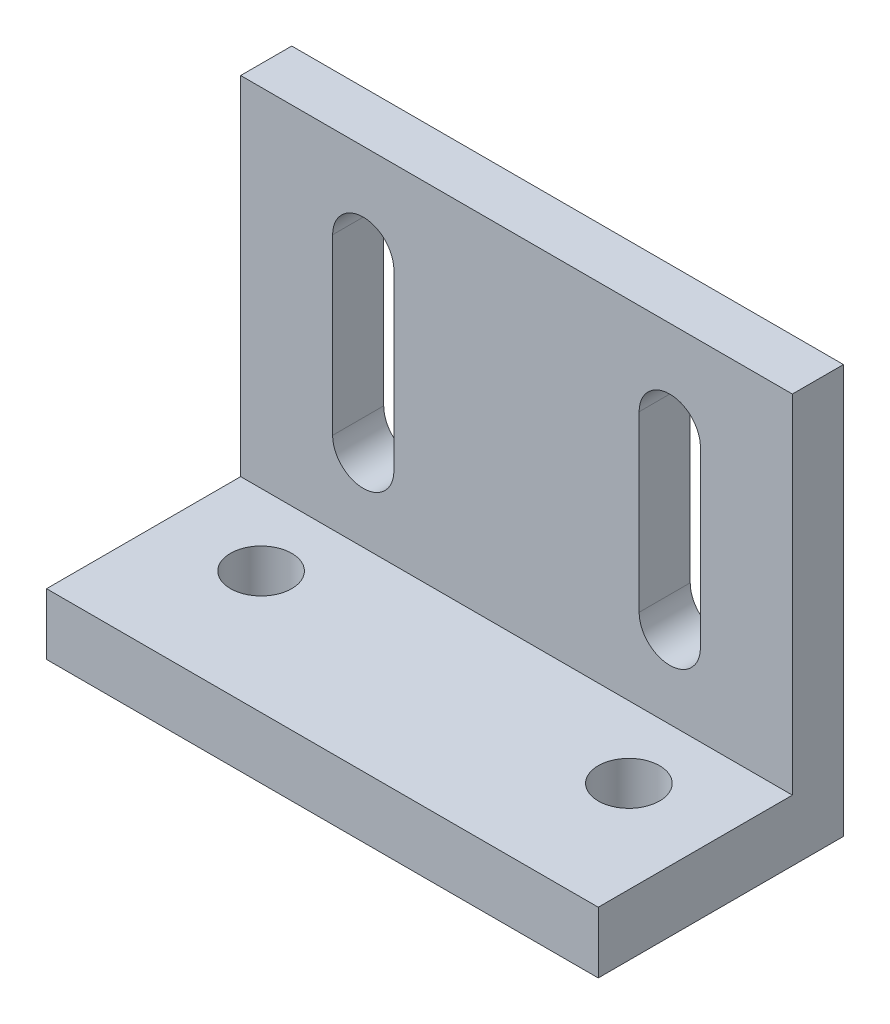
ISO-10303-21;
HEADER;
FILE_DESCRIPTION(('STEP AP214'),'2;1');
FILE_NAME('part.step','',(''),(''),'','','');
FILE_SCHEMA(('AUTOMOTIVE_DESIGN { 1 0 10303 214 1 1 1 1 }'));
ENDSEC;
DATA;
#1=APPLICATION_CONTEXT('core data for automotive mechanical design processes');
#2=APPLICATION_PROTOCOL_DEFINITION('international standard','automotive_design',2000,#1);
#3=PRODUCT_CONTEXT('',#1,'mechanical');
#4=PRODUCT('Part','Part','',(#3));
#5=PRODUCT_RELATED_PRODUCT_CATEGORY('part','',(#4));
#6=PRODUCT_DEFINITION_FORMATION('','',#4);
#7=PRODUCT_DEFINITION_CONTEXT('part definition',#1,'design');
#8=PRODUCT_DEFINITION('design','',#6,#7);
#9=PRODUCT_DEFINITION_SHAPE('','',#8);
#10=(LENGTH_UNIT() NAMED_UNIT(*) SI_UNIT(.MILLI.,.METRE.));
#11=(NAMED_UNIT(*) PLANE_ANGLE_UNIT() SI_UNIT($,.RADIAN.));
#12=(NAMED_UNIT(*) SI_UNIT($,.STERADIAN.) SOLID_ANGLE_UNIT());
#13=UNCERTAINTY_MEASURE_WITH_UNIT(LENGTH_MEASURE(1.E-05),#10,'distance_accuracy_value','');
#14=(GEOMETRIC_REPRESENTATION_CONTEXT(3) GLOBAL_UNCERTAINTY_ASSIGNED_CONTEXT((#13)) GLOBAL_UNIT_ASSIGNED_CONTEXT((#10,
#11,#12)) REPRESENTATION_CONTEXT('',''));
#15=CARTESIAN_POINT('',(0.,0.,0.));
#16=DIRECTION('',(0.,0.,1.));
#17=DIRECTION('',(1.,0.,0.));
#18=AXIS2_PLACEMENT_3D('',#15,#16,#17);
#19=CARTESIAN_POINT('',(13.5,20.,0.));
#20=DIRECTION('',(0.,0.,1.));
#21=DIRECTION('',(0.,-1.,0.));
#22=AXIS2_PLACEMENT_3D('',#19,#20,#21);
#23=PLANE('',#22);
#24=DIRECTION('',(0.,1.,0.));
#25=VECTOR('',#24,1.);
#26=CARTESIAN_POINT('',(-6.00050508926136,15.5,0.));
#27=LINE('',#26,#25);
#28=CARTESIAN_POINT('',(-6.00050508926136,6.99999999999999,0.));
#29=VERTEX_POINT('',#28);
#30=CARTESIAN_POINT('',(-6.00050508926136,15.5,0.));
#31=VERTEX_POINT('',#30);
#32=EDGE_CURVE('E176',#29,#31,#27,.T.);
#33=ORIENTED_EDGE('',*,*,#32,.T.);
#34=CARTESIAN_POINT('',(-7.49999999999999,15.5,0.));
#35=DIRECTION('',(0.,0.,1.));
#36=DIRECTION('',(1.,0.,0.));
#37=AXIS2_PLACEMENT_3D('',#34,#35,#36);
#38=CIRCLE('',#37,1.49949491073864);
#39=CARTESIAN_POINT('',(-8.99949491073863,15.5,0.));
#40=VERTEX_POINT('',#39);
#41=EDGE_CURVE('E167',#31,#40,#38,.T.);
#42=ORIENTED_EDGE('',*,*,#41,.T.);
#43=DIRECTION('',(0.,-1.,0.));
#44=VECTOR('',#43,1.);
#45=CARTESIAN_POINT('',(-8.99949491073863,15.5,0.));
#46=LINE('',#45,#44);
#47=CARTESIAN_POINT('',(-8.99949491073863,7.,0.));
#48=VERTEX_POINT('',#47);
#49=EDGE_CURVE('E179',#40,#48,#46,.T.);
#50=ORIENTED_EDGE('',*,*,#49,.T.);
#51=CARTESIAN_POINT('',(-7.5,7.,0.));
#52=DIRECTION('',(0.,0.,1.));
#53=DIRECTION('',(1.,0.,0.));
#54=AXIS2_PLACEMENT_3D('',#51,#52,#53);
#55=CIRCLE('',#54,1.49949491073864);
#56=EDGE_CURVE('E58',#48,#29,#55,.T.);
#57=ORIENTED_EDGE('',*,*,#56,.T.);
#58=EDGE_LOOP('',(#33,#42,#50,#57));
#59=FACE_BOUND('',#58,.T.);
#60=DIRECTION('',(0.,1.,0.));
#61=VECTOR('',#60,1.);
#62=CARTESIAN_POINT('',(8.99949491073864,15.5,0.));
#63=LINE('',#62,#61);
#64=CARTESIAN_POINT('',(8.99949491073865,7.,0.));
#65=VERTEX_POINT('',#64);
#66=CARTESIAN_POINT('',(8.99949491073864,15.5,0.));
#67=VERTEX_POINT('',#66);
#68=EDGE_CURVE('E227',#65,#67,#63,.T.);
#69=ORIENTED_EDGE('',*,*,#68,.T.);
#70=CARTESIAN_POINT('',(7.5,15.5,0.));
#71=DIRECTION('',(0.,0.,1.));
#72=DIRECTION('',(1.,0.,0.));
#73=AXIS2_PLACEMENT_3D('',#70,#71,#72);
#74=CIRCLE('',#73,1.49949491073864);
#75=CARTESIAN_POINT('',(6.00050508926136,15.5,0.));
#76=VERTEX_POINT('',#75);
#77=EDGE_CURVE('E217',#67,#76,#74,.T.);
#78=ORIENTED_EDGE('',*,*,#77,.T.);
#79=DIRECTION('',(0.,-1.,0.));
#80=VECTOR('',#79,1.);
#81=CARTESIAN_POINT('',(6.00050508926136,15.5,0.));
#82=LINE('',#81,#80);
#83=CARTESIAN_POINT('',(6.00050508926136,7.,0.));
#84=VERTEX_POINT('',#83);
#85=EDGE_CURVE('E220',#76,#84,#82,.T.);
#86=ORIENTED_EDGE('',*,*,#85,.T.);
#87=CARTESIAN_POINT('',(7.5,7.,0.));
#88=DIRECTION('',(0.,0.,1.));
#89=DIRECTION('',(1.,0.,0.));
#90=AXIS2_PLACEMENT_3D('',#87,#88,#89);
#91=CIRCLE('',#90,1.49949491073864);
#92=EDGE_CURVE('E67',#84,#65,#91,.T.);
#93=ORIENTED_EDGE('',*,*,#92,.T.);
#94=EDGE_LOOP('',(#69,#78,#86,#93));
#95=FACE_BOUND('',#94,.T.);
#96=DIRECTION('',(0.,1.,0.));
#97=VECTOR('',#96,1.);
#98=CARTESIAN_POINT('',(-13.5,20.,0.));
#99=LINE('',#98,#97);
#100=CARTESIAN_POINT('',(-13.5,0.,0.));
#101=VERTEX_POINT('',#100);
#102=CARTESIAN_POINT('',(-13.5,20.,0.));
#103=VERTEX_POINT('',#102);
#104=EDGE_CURVE('E285',#101,#103,#99,.T.);
#105=ORIENTED_EDGE('',*,*,#104,.T.);
#106=DIRECTION('',(-1.,0.,0.));
#107=VECTOR('',#106,1.);
#108=CARTESIAN_POINT('',(13.5,20.,0.));
#109=LINE('',#108,#107);
#110=CARTESIAN_POINT('',(13.5,20.,0.));
#111=VERTEX_POINT('',#110);
#112=EDGE_CURVE('E11',#111,#103,#109,.T.);
#113=ORIENTED_EDGE('',*,*,#112,.F.);
#114=DIRECTION('',(0.,1.,0.));
#115=VECTOR('',#114,1.);
#116=CARTESIAN_POINT('',(13.5,20.,0.));
#117=LINE('',#116,#115);
#118=CARTESIAN_POINT('',(13.5,0.,0.));
#119=VERTEX_POINT('',#118);
#120=EDGE_CURVE('E265',#119,#111,#117,.T.);
#121=ORIENTED_EDGE('',*,*,#120,.F.);
#122=DIRECTION('',(-1.,0.,0.));
#123=VECTOR('',#122,1.);
#124=CARTESIAN_POINT('',(13.5,0.,0.));
#125=LINE('',#124,#123);
#126=EDGE_CURVE('E284',#119,#101,#125,.T.);
#127=ORIENTED_EDGE('',*,*,#126,.T.);
#128=EDGE_LOOP('',(#105,#113,#121,#127));
#129=FACE_BOUND('',#128,.T.);
#130=ADVANCED_FACE('F38',(#59,#95,#129),#23,.F.);
#131=CARTESIAN_POINT('',(13.5,20.,2.5));
#132=DIRECTION('',(0.,-1.,0.));
#133=DIRECTION('',(0.,0.,-1.));
#134=AXIS2_PLACEMENT_3D('',#131,#132,#133);
#135=PLANE('',#134);
#136=DIRECTION('',(0.,0.,1.));
#137=VECTOR('',#136,1.);
#138=CARTESIAN_POINT('',(-13.5,20.,2.5));
#139=LINE('',#138,#137);
#140=CARTESIAN_POINT('',(-13.5,20.,2.5));
#141=VERTEX_POINT('',#140);
#142=EDGE_CURVE('E289',#103,#141,#139,.T.);
#143=ORIENTED_EDGE('',*,*,#142,.T.);
#144=DIRECTION('',(-1.,0.,0.));
#145=VECTOR('',#144,1.);
#146=CARTESIAN_POINT('',(13.5,20.,2.5));
#147=LINE('',#146,#145);
#148=CARTESIAN_POINT('',(13.5,20.,2.5));
#149=VERTEX_POINT('',#148);
#150=EDGE_CURVE('E47',#149,#141,#147,.T.);
#151=ORIENTED_EDGE('',*,*,#150,.F.);
#152=DIRECTION('',(0.,0.,1.));
#153=VECTOR('',#152,1.);
#154=CARTESIAN_POINT('',(13.5,20.,2.5));
#155=LINE('',#154,#153);
#156=EDGE_CURVE('E269',#111,#149,#155,.T.);
#157=ORIENTED_EDGE('',*,*,#156,.F.);
#158=ORIENTED_EDGE('',*,*,#112,.T.);
#159=EDGE_LOOP('',(#143,#151,#157,#158));
#160=FACE_BOUND('',#159,.T.);
#161=ADVANCED_FACE('F345',(#160),#135,.F.);
#162=CARTESIAN_POINT('',(13.5,3.,2.5));
#163=DIRECTION('',(0.,0.,-1.));
#164=DIRECTION('',(0.,1.,0.));
#165=AXIS2_PLACEMENT_3D('',#162,#163,#164);
#166=PLANE('',#165);
#167=DIRECTION('',(0.,-1.,0.));
#168=VECTOR('',#167,1.);
#169=CARTESIAN_POINT('',(-8.99949491073863,15.5,2.5));
#170=LINE('',#169,#168);
#171=CARTESIAN_POINT('',(-8.99949491073863,15.5,2.5));
#172=VERTEX_POINT('',#171);
#173=CARTESIAN_POINT('',(-8.99949491073864,7.,2.5));
#174=VERTEX_POINT('',#173);
#175=EDGE_CURVE('E202',#172,#174,#170,.T.);
#176=ORIENTED_EDGE('',*,*,#175,.F.);
#177=CARTESIAN_POINT('',(-7.49999999999999,15.5,2.5));
#178=DIRECTION('',(0.,0.,1.));
#179=DIRECTION('',(1.,0.,0.));
#180=AXIS2_PLACEMENT_3D('',#177,#178,#179);
#181=CIRCLE('',#180,1.49949491073864);
#182=CARTESIAN_POINT('',(-6.00050508926136,15.5,2.5));
#183=VERTEX_POINT('',#182);
#184=EDGE_CURVE('E170',#183,#172,#181,.T.);
#185=ORIENTED_EDGE('',*,*,#184,.F.);
#186=DIRECTION('',(0.,1.,0.));
#187=VECTOR('',#186,1.);
#188=CARTESIAN_POINT('',(-6.00050508926136,15.5,2.5));
#189=LINE('',#188,#187);
#190=CARTESIAN_POINT('',(-6.00050508926136,6.99999999999999,2.5));
#191=VERTEX_POINT('',#190);
#192=EDGE_CURVE('E187',#191,#183,#189,.T.);
#193=ORIENTED_EDGE('',*,*,#192,.F.);
#194=CARTESIAN_POINT('',(-7.5,7.,2.5));
#195=DIRECTION('',(0.,0.,1.));
#196=DIRECTION('',(1.,0.,0.));
#197=AXIS2_PLACEMENT_3D('',#194,#195,#196);
#198=CIRCLE('',#197,1.49949491073864);
#199=EDGE_CURVE('E193',#174,#191,#198,.T.);
#200=ORIENTED_EDGE('',*,*,#199,.F.);
#201=EDGE_LOOP('',(#176,#185,#193,#200));
#202=FACE_BOUND('',#201,.T.);
#203=DIRECTION('',(0.,-1.,0.));
#204=VECTOR('',#203,1.);
#205=CARTESIAN_POINT('',(6.00050508926136,15.5,2.5));
#206=LINE('',#205,#204);
#207=CARTESIAN_POINT('',(6.00050508926136,15.5,2.5));
#208=VERTEX_POINT('',#207);
#209=CARTESIAN_POINT('',(6.00050508926136,7.,2.5));
#210=VERTEX_POINT('',#209);
#211=EDGE_CURVE('E235',#208,#210,#206,.T.);
#212=ORIENTED_EDGE('',*,*,#211,.F.);
#213=CARTESIAN_POINT('',(7.5,15.5,2.5));
#214=DIRECTION('',(0.,0.,1.));
#215=DIRECTION('',(1.,0.,0.));
#216=AXIS2_PLACEMENT_3D('',#213,#214,#215);
#217=CIRCLE('',#216,1.49949491073864);
#218=CARTESIAN_POINT('',(8.99949491073864,15.5,2.5));
#219=VERTEX_POINT('',#218);
#220=EDGE_CURVE('E232',#219,#208,#217,.T.);
#221=ORIENTED_EDGE('',*,*,#220,.F.);
#222=DIRECTION('',(0.,1.,0.));
#223=VECTOR('',#222,1.);
#224=CARTESIAN_POINT('',(8.99949491073864,15.5,2.5));
#225=LINE('',#224,#223);
#226=CARTESIAN_POINT('',(8.99949491073865,7.,2.5));
#227=VERTEX_POINT('',#226);
#228=EDGE_CURVE('E221',#227,#219,#225,.T.);
#229=ORIENTED_EDGE('',*,*,#228,.F.);
#230=CARTESIAN_POINT('',(7.5,7.,2.5));
#231=DIRECTION('',(0.,0.,1.));
#232=DIRECTION('',(1.,0.,0.));
#233=AXIS2_PLACEMENT_3D('',#230,#231,#232);
#234=CIRCLE('',#233,1.49949491073864);
#235=EDGE_CURVE('E239',#210,#227,#234,.T.);
#236=ORIENTED_EDGE('',*,*,#235,.F.);
#237=EDGE_LOOP('',(#212,#221,#229,#236));
#238=FACE_BOUND('',#237,.T.);
#239=DIRECTION('',(0.,-1.,0.));
#240=VECTOR('',#239,1.);
#241=CARTESIAN_POINT('',(-13.5,3.,2.5));
#242=LINE('',#241,#240);
#243=CARTESIAN_POINT('',(-13.5,3.,2.5));
#244=VERTEX_POINT('',#243);
#245=EDGE_CURVE('E291',#141,#244,#242,.T.);
#246=ORIENTED_EDGE('',*,*,#245,.T.);
#247=DIRECTION('',(-1.,0.,0.));
#248=VECTOR('',#247,1.);
#249=CARTESIAN_POINT('',(13.5,3.,2.5));
#250=LINE('',#249,#248);
#251=CARTESIAN_POINT('',(13.5,3.,2.5));
#252=VERTEX_POINT('',#251);
#253=EDGE_CURVE('E312',#252,#244,#250,.T.);
#254=ORIENTED_EDGE('',*,*,#253,.F.);
#255=DIRECTION('',(0.,-1.,0.));
#256=VECTOR('',#255,1.);
#257=CARTESIAN_POINT('',(13.5,3.,2.5));
#258=LINE('',#257,#256);
#259=EDGE_CURVE('E272',#149,#252,#258,.T.);
#260=ORIENTED_EDGE('',*,*,#259,.F.);
#261=ORIENTED_EDGE('',*,*,#150,.T.);
#262=EDGE_LOOP('',(#246,#254,#260,#261));
#263=FACE_BOUND('',#262,.T.);
#264=ADVANCED_FACE('F349',(#202,#238,#263),#166,.F.);
#265=CARTESIAN_POINT('',(13.5,3.,12.));
#266=DIRECTION('',(0.,-1.,0.));
#267=DIRECTION('',(0.,0.,-1.));
#268=AXIS2_PLACEMENT_3D('',#265,#266,#267);
#269=PLANE('',#268);
#270=CARTESIAN_POINT('',(-9.,3.,6.));
#271=DIRECTION('',(0.,1.,0.));
#272=DIRECTION('',(0.,0.,1.));
#273=AXIS2_PLACEMENT_3D('',#270,#271,#272);
#274=CIRCLE('',#273,1.5);
#275=CARTESIAN_POINT('',(-9.,3.,7.5));
#276=VERTEX_POINT('',#275);
#277=EDGE_CURVE('E257',#276,#276,#274,.T.);
#278=ORIENTED_EDGE('',*,*,#277,.F.);
#279=EDGE_LOOP('',(#278));
#280=FACE_BOUND('',#279,.T.);
#281=CARTESIAN_POINT('',(9.,3.,6.));
#282=DIRECTION('',(0.,1.,0.));
#283=DIRECTION('',(0.,0.,1.));
#284=AXIS2_PLACEMENT_3D('',#281,#282,#283);
#285=CIRCLE('',#284,1.5);
#286=CARTESIAN_POINT('',(9.,3.,7.5));
#287=VERTEX_POINT('',#286);
#288=EDGE_CURVE('E211',#287,#287,#285,.T.);
#289=ORIENTED_EDGE('',*,*,#288,.F.);
#290=EDGE_LOOP('',(#289));
#291=FACE_BOUND('',#290,.T.);
#292=DIRECTION('',(0.,0.,1.));
#293=VECTOR('',#292,1.);
#294=CARTESIAN_POINT('',(-13.5,3.,12.));
#295=LINE('',#294,#293);
#296=CARTESIAN_POINT('',(-13.5,3.,12.));
#297=VERTEX_POINT('',#296);
#298=EDGE_CURVE('E294',#244,#297,#295,.T.);
#299=ORIENTED_EDGE('',*,*,#298,.T.);
#300=DIRECTION('',(-1.,0.,0.));
#301=VECTOR('',#300,1.);
#302=CARTESIAN_POINT('',(13.5,3.,12.));
#303=LINE('',#302,#301);
#304=CARTESIAN_POINT('',(13.5,3.,12.));
#305=VERTEX_POINT('',#304);
#306=EDGE_CURVE('E308',#305,#297,#303,.T.);
#307=ORIENTED_EDGE('',*,*,#306,.F.);
#308=DIRECTION('',(0.,0.,1.));
#309=VECTOR('',#308,1.);
#310=CARTESIAN_POINT('',(13.5,3.,12.));
#311=LINE('',#310,#309);
#312=EDGE_CURVE('E275',#252,#305,#311,.T.);
#313=ORIENTED_EDGE('',*,*,#312,.F.);
#314=ORIENTED_EDGE('',*,*,#253,.T.);
#315=EDGE_LOOP('',(#299,#307,#313,#314));
#316=FACE_BOUND('',#315,.T.);
#317=ADVANCED_FACE('F354',(#280,#291,#316),#269,.F.);
#318=CARTESIAN_POINT('',(13.5,0.,12.));
#319=DIRECTION('',(0.,0.,-1.));
#320=DIRECTION('',(-1.,0.,0.));
#321=AXIS2_PLACEMENT_3D('',#318,#319,#320);
#322=PLANE('',#321);
#323=DIRECTION('',(0.,-1.,0.));
#324=VECTOR('',#323,1.);
#325=CARTESIAN_POINT('',(-13.5,0.,12.));
#326=LINE('',#325,#324);
#327=CARTESIAN_POINT('',(-13.5,0.,12.));
#328=VERTEX_POINT('',#327);
#329=EDGE_CURVE('E297',#297,#328,#326,.T.);
#330=ORIENTED_EDGE('',*,*,#329,.T.);
#331=DIRECTION('',(-1.,0.,0.));
#332=VECTOR('',#331,1.);
#333=CARTESIAN_POINT('',(13.5,0.,12.));
#334=LINE('',#333,#332);
#335=CARTESIAN_POINT('',(13.5,0.,12.));
#336=VERTEX_POINT('',#335);
#337=EDGE_CURVE('E304',#336,#328,#334,.T.);
#338=ORIENTED_EDGE('',*,*,#337,.F.);
#339=DIRECTION('',(0.,-1.,0.));
#340=VECTOR('',#339,1.);
#341=CARTESIAN_POINT('',(13.5,0.,12.));
#342=LINE('',#341,#340);
#343=EDGE_CURVE('E278',#305,#336,#342,.T.);
#344=ORIENTED_EDGE('',*,*,#343,.F.);
#345=ORIENTED_EDGE('',*,*,#306,.T.);
#346=EDGE_LOOP('',(#330,#338,#344,#345));
#347=FACE_BOUND('',#346,.T.);
#348=ADVANCED_FACE('F360',(#347),#322,.F.);
#349=CARTESIAN_POINT('',(13.5,0.,0.));
#350=DIRECTION('',(0.,1.,0.));
#351=DIRECTION('',(0.,0.,1.));
#352=AXIS2_PLACEMENT_3D('',#349,#350,#351);
#353=PLANE('',#352);
#354=CARTESIAN_POINT('',(-9.,0.,6.));
#355=DIRECTION('',(0.,1.,0.));
#356=DIRECTION('',(0.,0.,1.));
#357=AXIS2_PLACEMENT_3D('',#354,#355,#356);
#358=CIRCLE('',#357,1.5);
#359=CARTESIAN_POINT('',(-9.,0.,7.5));
#360=VERTEX_POINT('',#359);
#361=EDGE_CURVE('E41',#360,#360,#358,.T.);
#362=ORIENTED_EDGE('',*,*,#361,.T.);
#363=EDGE_LOOP('',(#362));
#364=FACE_BOUND('',#363,.T.);
#365=CARTESIAN_POINT('',(9.,0.,6.));
#366=DIRECTION('',(0.,1.,0.));
#367=DIRECTION('',(0.,0.,1.));
#368=AXIS2_PLACEMENT_3D('',#365,#366,#367);
#369=CIRCLE('',#368,1.5);
#370=CARTESIAN_POINT('',(9.,0.,7.5));
#371=VERTEX_POINT('',#370);
#372=EDGE_CURVE('E261',#371,#371,#369,.T.);
#373=ORIENTED_EDGE('',*,*,#372,.T.);
#374=EDGE_LOOP('',(#373));
#375=FACE_BOUND('',#374,.T.);
#376=DIRECTION('',(0.,0.,-1.));
#377=VECTOR('',#376,1.);
#378=CARTESIAN_POINT('',(-13.5,0.,0.));
#379=LINE('',#378,#377);
#380=EDGE_CURVE('E270',#328,#101,#379,.T.);
#381=ORIENTED_EDGE('',*,*,#380,.T.);
#382=ORIENTED_EDGE('',*,*,#126,.F.);
#383=DIRECTION('',(0.,0.,-1.));
#384=VECTOR('',#383,1.);
#385=CARTESIAN_POINT('',(13.5,0.,0.));
#386=LINE('',#385,#384);
#387=EDGE_CURVE('E281',#336,#119,#386,.T.);
#388=ORIENTED_EDGE('',*,*,#387,.F.);
#389=ORIENTED_EDGE('',*,*,#337,.T.);
#390=EDGE_LOOP('',(#381,#382,#388,#389));
#391=FACE_BOUND('',#390,.T.);
#392=ADVANCED_FACE('F326',(#364,#375,#391),#353,.F.);
#393=CARTESIAN_POINT('',(13.5,0.,0.));
#394=DIRECTION('',(-1.,0.,0.));
#395=DIRECTION('',(0.,0.,1.));
#396=AXIS2_PLACEMENT_3D('',#393,#394,#395);
#397=PLANE('',#396);
#398=ORIENTED_EDGE('',*,*,#120,.T.);
#399=ORIENTED_EDGE('',*,*,#156,.T.);
#400=ORIENTED_EDGE('',*,*,#259,.T.);
#401=ORIENTED_EDGE('',*,*,#312,.T.);
#402=ORIENTED_EDGE('',*,*,#343,.T.);
#403=ORIENTED_EDGE('',*,*,#387,.T.);
#404=EDGE_LOOP('',(#398,#399,#400,#401,#402,#403));
#405=FACE_BOUND('',#404,.T.);
#406=ADVANCED_FACE('F367',(#405),#397,.F.);
#407=CARTESIAN_POINT('',(-13.5,0.,0.));
#408=DIRECTION('',(-1.,0.,0.));
#409=DIRECTION('',(0.,0.,1.));
#410=AXIS2_PLACEMENT_3D('',#407,#408,#409);
#411=PLANE('',#410);
#412=ORIENTED_EDGE('',*,*,#104,.F.);
#413=ORIENTED_EDGE('',*,*,#380,.F.);
#414=ORIENTED_EDGE('',*,*,#329,.F.);
#415=ORIENTED_EDGE('',*,*,#298,.F.);
#416=ORIENTED_EDGE('',*,*,#245,.F.);
#417=ORIENTED_EDGE('',*,*,#142,.F.);
#418=EDGE_LOOP('',(#412,#413,#414,#415,#416,#417));
#419=FACE_BOUND('',#418,.T.);
#420=ADVANCED_FACE('F341',(#419),#411,.T.);
#421=CARTESIAN_POINT('',(9.,-17.,6.));
#422=DIRECTION('',(0.,1.,0.));
#423=DIRECTION('',(0.,0.,1.));
#424=AXIS2_PLACEMENT_3D('',#421,#422,#423);
#425=CYLINDRICAL_SURFACE('',#424,1.5);
#426=ORIENTED_EDGE('',*,*,#288,.T.);
#427=EDGE_LOOP('',(#426));
#428=FACE_BOUND('',#427,.T.);
#429=ORIENTED_EDGE('',*,*,#372,.F.);
#430=EDGE_LOOP('',(#429));
#431=FACE_BOUND('',#430,.T.);
#432=ADVANCED_FACE('F331',(#428,#431),#425,.F.);
#433=CARTESIAN_POINT('',(-9.,-17.,6.));
#434=DIRECTION('',(0.,1.,0.));
#435=DIRECTION('',(0.,0.,1.));
#436=AXIS2_PLACEMENT_3D('',#433,#434,#435);
#437=CYLINDRICAL_SURFACE('',#436,1.5);
#438=ORIENTED_EDGE('',*,*,#277,.T.);
#439=EDGE_LOOP('',(#438));
#440=FACE_BOUND('',#439,.T.);
#441=ORIENTED_EDGE('',*,*,#361,.F.);
#442=EDGE_LOOP('',(#441));
#443=FACE_BOUND('',#442,.T.);
#444=ADVANCED_FACE('F328',(#440,#443),#437,.F.);
#445=CARTESIAN_POINT('',(7.5,15.5,0.));
#446=DIRECTION('',(0.,0.,1.));
#447=DIRECTION('',(1.,0.,0.));
#448=AXIS2_PLACEMENT_3D('',#445,#446,#447);
#449=CYLINDRICAL_SURFACE('',#448,1.49949491073864);
#450=ORIENTED_EDGE('',*,*,#220,.T.);
#451=DIRECTION('',(0.,0.,1.));
#452=VECTOR('',#451,1.);
#453=CARTESIAN_POINT('',(6.00050508926136,15.5,0.));
#454=LINE('',#453,#452);
#455=EDGE_CURVE('E231',#76,#208,#454,.T.);
#456=ORIENTED_EDGE('',*,*,#455,.F.);
#457=ORIENTED_EDGE('',*,*,#77,.F.);
#458=DIRECTION('',(0.,0.,1.));
#459=VECTOR('',#458,1.);
#460=CARTESIAN_POINT('',(8.99949491073864,15.5,0.));
#461=LINE('',#460,#459);
#462=EDGE_CURVE('E203',#67,#219,#461,.T.);
#463=ORIENTED_EDGE('',*,*,#462,.T.);
#464=EDGE_LOOP('',(#450,#456,#457,#463));
#465=FACE_BOUND('',#464,.T.);
#466=ADVANCED_FACE('F330',(#465),#449,.F.);
#467=CARTESIAN_POINT('',(8.99949491073864,15.5,0.));
#468=DIRECTION('',(1.,0.,0.));
#469=DIRECTION('',(0.,1.,0.));
#470=AXIS2_PLACEMENT_3D('',#467,#468,#469);
#471=PLANE('',#470);
#472=ORIENTED_EDGE('',*,*,#228,.T.);
#473=ORIENTED_EDGE('',*,*,#462,.F.);
#474=ORIENTED_EDGE('',*,*,#68,.F.);
#475=DIRECTION('',(0.,0.,1.));
#476=VECTOR('',#475,1.);
#477=CARTESIAN_POINT('',(8.99949491073865,7.,0.));
#478=LINE('',#477,#476);
#479=EDGE_CURVE('E248',#65,#227,#478,.T.);
#480=ORIENTED_EDGE('',*,*,#479,.T.);
#481=EDGE_LOOP('',(#472,#473,#474,#480));
#482=FACE_BOUND('',#481,.T.);
#483=ADVANCED_FACE('F338',(#482),#471,.F.);
#484=CARTESIAN_POINT('',(7.5,7.,0.));
#485=DIRECTION('',(0.,0.,1.));
#486=DIRECTION('',(1.,0.,0.));
#487=AXIS2_PLACEMENT_3D('',#484,#485,#486);
#488=CYLINDRICAL_SURFACE('',#487,1.49949491073864);
#489=ORIENTED_EDGE('',*,*,#235,.T.);
#490=ORIENTED_EDGE('',*,*,#479,.F.);
#491=ORIENTED_EDGE('',*,*,#92,.F.);
#492=DIRECTION('',(0.,0.,1.));
#493=VECTOR('',#492,1.);
#494=CARTESIAN_POINT('',(6.00050508926136,7.,0.));
#495=LINE('',#494,#493);
#496=EDGE_CURVE('E251',#84,#210,#495,.T.);
#497=ORIENTED_EDGE('',*,*,#496,.T.);
#498=EDGE_LOOP('',(#489,#490,#491,#497));
#499=FACE_BOUND('',#498,.T.);
#500=ADVANCED_FACE('F441',(#499),#488,.F.);
#501=CARTESIAN_POINT('',(6.00050508926136,15.5,0.));
#502=DIRECTION('',(-1.,0.,0.));
#503=DIRECTION('',(0.,-1.,0.));
#504=AXIS2_PLACEMENT_3D('',#501,#502,#503);
#505=PLANE('',#504);
#506=ORIENTED_EDGE('',*,*,#211,.T.);
#507=ORIENTED_EDGE('',*,*,#496,.F.);
#508=ORIENTED_EDGE('',*,*,#85,.F.);
#509=ORIENTED_EDGE('',*,*,#455,.T.);
#510=EDGE_LOOP('',(#506,#507,#508,#509));
#511=FACE_BOUND('',#510,.T.);
#512=ADVANCED_FACE('F451',(#511),#505,.F.);
#513=CARTESIAN_POINT('',(-7.49999999999999,15.5,0.));
#514=DIRECTION('',(0.,0.,1.));
#515=DIRECTION('',(1.,0.,0.));
#516=AXIS2_PLACEMENT_3D('',#513,#514,#515);
#517=CYLINDRICAL_SURFACE('',#516,1.49949491073864);
#518=ORIENTED_EDGE('',*,*,#184,.T.);
#519=DIRECTION('',(0.,0.,1.));
#520=VECTOR('',#519,1.);
#521=CARTESIAN_POINT('',(-8.99949491073863,15.5,0.));
#522=LINE('',#521,#520);
#523=EDGE_CURVE('E163',#40,#172,#522,.T.);
#524=ORIENTED_EDGE('',*,*,#523,.F.);
#525=ORIENTED_EDGE('',*,*,#41,.F.);
#526=DIRECTION('',(0.,0.,1.));
#527=VECTOR('',#526,1.);
#528=CARTESIAN_POINT('',(-6.00050508926136,15.5,0.));
#529=LINE('',#528,#527);
#530=EDGE_CURVE('E209',#31,#183,#529,.T.);
#531=ORIENTED_EDGE('',*,*,#530,.T.);
#532=EDGE_LOOP('',(#518,#524,#525,#531));
#533=FACE_BOUND('',#532,.T.);
#534=ADVANCED_FACE('F165',(#533),#517,.F.);
#535=CARTESIAN_POINT('',(-6.00050508926136,15.5,0.));
#536=DIRECTION('',(1.,0.,0.));
#537=DIRECTION('',(0.,0.,-1.));
#538=AXIS2_PLACEMENT_3D('',#535,#536,#537);
#539=PLANE('',#538);
#540=ORIENTED_EDGE('',*,*,#192,.T.);
#541=ORIENTED_EDGE('',*,*,#530,.F.);
#542=ORIENTED_EDGE('',*,*,#32,.F.);
#543=DIRECTION('',(0.,0.,1.));
#544=VECTOR('',#543,1.);
#545=CARTESIAN_POINT('',(-6.00050508926136,6.99999999999999,0.));
#546=LINE('',#545,#544);
#547=EDGE_CURVE('E212',#29,#191,#546,.T.);
#548=ORIENTED_EDGE('',*,*,#547,.T.);
#549=EDGE_LOOP('',(#540,#541,#542,#548));
#550=FACE_BOUND('',#549,.T.);
#551=ADVANCED_FACE('F469',(#550),#539,.F.);
#552=CARTESIAN_POINT('',(-7.5,7.,0.));
#553=DIRECTION('',(0.,0.,1.));
#554=DIRECTION('',(1.,0.,0.));
#555=AXIS2_PLACEMENT_3D('',#552,#553,#554);
#556=CYLINDRICAL_SURFACE('',#555,1.49949491073864);
#557=ORIENTED_EDGE('',*,*,#199,.T.);
#558=ORIENTED_EDGE('',*,*,#547,.F.);
#559=ORIENTED_EDGE('',*,*,#56,.F.);
#560=DIRECTION('',(0.,0.,1.));
#561=VECTOR('',#560,1.);
#562=CARTESIAN_POINT('',(-8.99949491073864,7.,0.));
#563=LINE('',#562,#561);
#564=EDGE_CURVE('E175',#48,#174,#563,.T.);
#565=ORIENTED_EDGE('',*,*,#564,.T.);
#566=EDGE_LOOP('',(#557,#558,#559,#565));
#567=FACE_BOUND('',#566,.T.);
#568=ADVANCED_FACE('F478',(#567),#556,.F.);
#569=CARTESIAN_POINT('',(-8.99949491073863,15.5,0.));
#570=DIRECTION('',(-1.,0.,0.));
#571=DIRECTION('',(0.,0.,1.));
#572=AXIS2_PLACEMENT_3D('',#569,#570,#571);
#573=PLANE('',#572);
#574=ORIENTED_EDGE('',*,*,#175,.T.);
#575=ORIENTED_EDGE('',*,*,#564,.F.);
#576=ORIENTED_EDGE('',*,*,#49,.F.);
#577=ORIENTED_EDGE('',*,*,#523,.T.);
#578=EDGE_LOOP('',(#574,#575,#576,#577));
#579=FACE_BOUND('',#578,.T.);
#580=ADVANCED_FACE('F180',(#579),#573,.F.);
#581=CLOSED_SHELL('',(#130,#161,#264,#317,#348,#392,#406,#420,#432,#444,#466,#483,#500,#512,
#534,#551,#568,#580));
#582=MANIFOLD_SOLID_BREP('B2',#581);
#583=ADVANCED_BREP_SHAPE_REPRESENTATION('',(#18,#582),#14);
#584=SHAPE_DEFINITION_REPRESENTATION(#9,#583);
ENDSEC;
END-ISO-10303-21;
